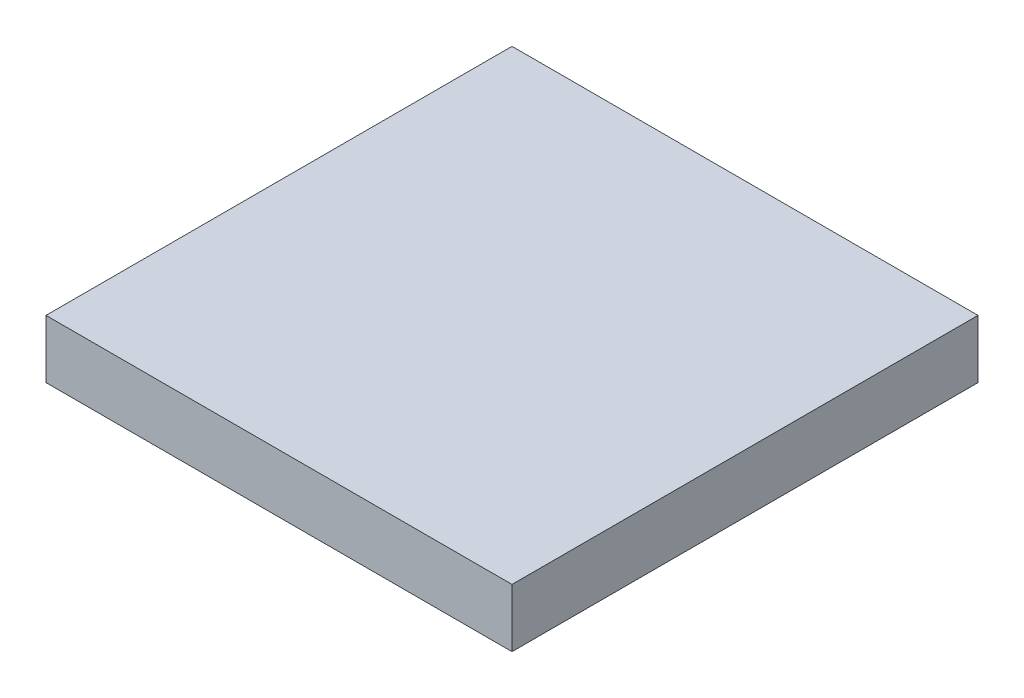
ISO-10303-21;
HEADER;
FILE_DESCRIPTION(('STEP AP214'),'2;1');
FILE_NAME('part.step','',(''),(''),'','','');
FILE_SCHEMA(('AUTOMOTIVE_DESIGN { 1 0 10303 214 1 1 1 1 }'));
ENDSEC;
DATA;
#1=APPLICATION_CONTEXT('core data for automotive mechanical design processes');
#2=APPLICATION_PROTOCOL_DEFINITION('international standard','automotive_design',2000,#1);
#3=PRODUCT_CONTEXT('',#1,'mechanical');
#4=PRODUCT('Part','Part','',(#3));
#5=PRODUCT_RELATED_PRODUCT_CATEGORY('part','',(#4));
#6=PRODUCT_DEFINITION_FORMATION('','',#4);
#7=PRODUCT_DEFINITION_CONTEXT('part definition',#1,'design');
#8=PRODUCT_DEFINITION('design','',#6,#7);
#9=PRODUCT_DEFINITION_SHAPE('','',#8);
#10=(LENGTH_UNIT() NAMED_UNIT(*) SI_UNIT(.MILLI.,.METRE.));
#11=(NAMED_UNIT(*) PLANE_ANGLE_UNIT() SI_UNIT($,.RADIAN.));
#12=(NAMED_UNIT(*) SI_UNIT($,.STERADIAN.) SOLID_ANGLE_UNIT());
#13=UNCERTAINTY_MEASURE_WITH_UNIT(LENGTH_MEASURE(1.E-05),#10,'distance_accuracy_value','');
#14=(GEOMETRIC_REPRESENTATION_CONTEXT(3) GLOBAL_UNCERTAINTY_ASSIGNED_CONTEXT((#13)) GLOBAL_UNIT_ASSIGNED_CONTEXT((#10,
#11,#12)) REPRESENTATION_CONTEXT('',''));
#15=CARTESIAN_POINT('',(0.,0.,0.));
#16=DIRECTION('',(0.,0.,1.));
#17=DIRECTION('',(1.,0.,0.));
#18=AXIS2_PLACEMENT_3D('',#15,#16,#17);
#19=CARTESIAN_POINT('',(-0.2,0.05,-0.2));
#20=DIRECTION('',(1.,0.,0.));
#21=DIRECTION('',(0.,0.,-1.));
#22=AXIS2_PLACEMENT_3D('',#19,#20,#21);
#23=PLANE('',#22);
#24=DIRECTION('',(0.,0.,1.));
#25=VECTOR('',#24,1.);
#26=CARTESIAN_POINT('',(-0.2,0.,-0.2));
#27=LINE('',#26,#25);
#28=CARTESIAN_POINT('',(-0.2,0.,-0.2));
#29=VERTEX_POINT('',#28);
#30=CARTESIAN_POINT('',(-0.2,0.,0.2));
#31=VERTEX_POINT('',#30);
#32=EDGE_CURVE('E92',#29,#31,#27,.T.);
#33=ORIENTED_EDGE('',*,*,#32,.T.);
#34=DIRECTION('',(0.,-1.,0.));
#35=VECTOR('',#34,1.);
#36=CARTESIAN_POINT('',(-0.2,0.05,0.2));
#37=LINE('',#36,#35);
#38=CARTESIAN_POINT('',(-0.2,0.05,0.2));
#39=VERTEX_POINT('',#38);
#40=EDGE_CURVE('E11',#39,#31,#37,.T.);
#41=ORIENTED_EDGE('',*,*,#40,.F.);
#42=DIRECTION('',(0.,0.,1.));
#43=VECTOR('',#42,1.);
#44=CARTESIAN_POINT('',(-0.2,0.05,-0.2));
#45=LINE('',#44,#43);
#46=CARTESIAN_POINT('',(-0.2,0.05,-0.2));
#47=VERTEX_POINT('',#46);
#48=EDGE_CURVE('E80',#47,#39,#45,.T.);
#49=ORIENTED_EDGE('',*,*,#48,.F.);
#50=DIRECTION('',(0.,-1.,0.));
#51=VECTOR('',#50,1.);
#52=CARTESIAN_POINT('',(-0.2,0.05,-0.2));
#53=LINE('',#52,#51);
#54=EDGE_CURVE('E88',#47,#29,#53,.T.);
#55=ORIENTED_EDGE('',*,*,#54,.T.);
#56=EDGE_LOOP('',(#33,#41,#49,#55));
#57=FACE_BOUND('',#56,.T.);
#58=ADVANCED_FACE('F29',(#57),#23,.F.);
#59=CARTESIAN_POINT('',(-0.2,0.05,0.2));
#60=DIRECTION('',(0.,0.,-1.));
#61=DIRECTION('',(-1.,0.,0.));
#62=AXIS2_PLACEMENT_3D('',#59,#60,#61);
#63=PLANE('',#62);
#64=DIRECTION('',(1.,0.,0.));
#65=VECTOR('',#64,1.);
#66=CARTESIAN_POINT('',(-0.2,0.,0.2));
#67=LINE('',#66,#65);
#68=CARTESIAN_POINT('',(0.2,0.,0.2));
#69=VERTEX_POINT('',#68);
#70=EDGE_CURVE('E84',#31,#69,#67,.T.);
#71=ORIENTED_EDGE('',*,*,#70,.T.);
#72=DIRECTION('',(0.,-1.,0.));
#73=VECTOR('',#72,1.);
#74=CARTESIAN_POINT('',(0.2,0.05,0.2));
#75=LINE('',#74,#73);
#76=CARTESIAN_POINT('',(0.2,0.05,0.2));
#77=VERTEX_POINT('',#76);
#78=EDGE_CURVE('E37',#77,#69,#75,.T.);
#79=ORIENTED_EDGE('',*,*,#78,.F.);
#80=DIRECTION('',(1.,0.,0.));
#81=VECTOR('',#80,1.);
#82=CARTESIAN_POINT('',(-0.2,0.05,0.2));
#83=LINE('',#82,#81);
#84=EDGE_CURVE('E75',#39,#77,#83,.T.);
#85=ORIENTED_EDGE('',*,*,#84,.F.);
#86=ORIENTED_EDGE('',*,*,#40,.T.);
#87=EDGE_LOOP('',(#71,#79,#85,#86));
#88=FACE_BOUND('',#87,.T.);
#89=ADVANCED_FACE('F83',(#88),#63,.F.);
#90=CARTESIAN_POINT('',(0.2,0.05,-0.2));
#91=DIRECTION('',(-1.,0.,0.));
#92=DIRECTION('',(0.,0.,1.));
#93=AXIS2_PLACEMENT_3D('',#90,#91,#92);
#94=PLANE('',#93);
#95=DIRECTION('',(0.,0.,-1.));
#96=VECTOR('',#95,1.);
#97=CARTESIAN_POINT('',(0.2,0.,-0.2));
#98=LINE('',#97,#96);
#99=CARTESIAN_POINT('',(0.2,0.,-0.2));
#100=VERTEX_POINT('',#99);
#101=EDGE_CURVE('E62',#69,#100,#98,.T.);
#102=ORIENTED_EDGE('',*,*,#101,.T.);
#103=DIRECTION('',(0.,-1.,0.));
#104=VECTOR('',#103,1.);
#105=CARTESIAN_POINT('',(0.2,0.05,-0.2));
#106=LINE('',#105,#104);
#107=CARTESIAN_POINT('',(0.2,0.05,-0.2));
#108=VERTEX_POINT('',#107);
#109=EDGE_CURVE('E85',#108,#100,#106,.T.);
#110=ORIENTED_EDGE('',*,*,#109,.F.);
#111=DIRECTION('',(0.,0.,-1.));
#112=VECTOR('',#111,1.);
#113=CARTESIAN_POINT('',(0.2,0.05,-0.2));
#114=LINE('',#113,#112);
#115=EDGE_CURVE('E78',#77,#108,#114,.T.);
#116=ORIENTED_EDGE('',*,*,#115,.F.);
#117=ORIENTED_EDGE('',*,*,#78,.T.);
#118=EDGE_LOOP('',(#102,#110,#116,#117));
#119=FACE_BOUND('',#118,.T.);
#120=ADVANCED_FACE('F86',(#119),#94,.F.);
#121=CARTESIAN_POINT('',(-0.2,0.05,-0.2));
#122=DIRECTION('',(0.,0.,1.));
#123=DIRECTION('',(1.,0.,0.));
#124=AXIS2_PLACEMENT_3D('',#121,#122,#123);
#125=PLANE('',#124);
#126=DIRECTION('',(-1.,0.,0.));
#127=VECTOR('',#126,1.);
#128=CARTESIAN_POINT('',(-0.2,0.,-0.2));
#129=LINE('',#128,#127);
#130=EDGE_CURVE('E68',#100,#29,#129,.T.);
#131=ORIENTED_EDGE('',*,*,#130,.T.);
#132=ORIENTED_EDGE('',*,*,#54,.F.);
#133=DIRECTION('',(-1.,0.,0.));
#134=VECTOR('',#133,1.);
#135=CARTESIAN_POINT('',(-0.2,0.05,-0.2));
#136=LINE('',#135,#134);
#137=EDGE_CURVE('E45',#108,#47,#136,.T.);
#138=ORIENTED_EDGE('',*,*,#137,.F.);
#139=ORIENTED_EDGE('',*,*,#109,.T.);
#140=EDGE_LOOP('',(#131,#132,#138,#139));
#141=FACE_BOUND('',#140,.T.);
#142=ADVANCED_FACE('F99',(#141),#125,.F.);
#143=CARTESIAN_POINT('',(0.,0.05,0.));
#144=DIRECTION('',(0.,1.,0.));
#145=DIRECTION('',(0.,0.,1.));
#146=AXIS2_PLACEMENT_3D('',#143,#144,#145);
#147=PLANE('',#146);
#148=ORIENTED_EDGE('',*,*,#48,.T.);
#149=ORIENTED_EDGE('',*,*,#84,.T.);
#150=ORIENTED_EDGE('',*,*,#115,.T.);
#151=ORIENTED_EDGE('',*,*,#137,.T.);
#152=EDGE_LOOP('',(#148,#149,#150,#151));
#153=FACE_BOUND('',#152,.T.);
#154=ADVANCED_FACE('F76',(#153),#147,.T.);
#155=CARTESIAN_POINT('',(0.,0.,0.));
#156=DIRECTION('',(0.,1.,0.));
#157=DIRECTION('',(0.,0.,1.));
#158=AXIS2_PLACEMENT_3D('',#155,#156,#157);
#159=PLANE('',#158);
#160=ORIENTED_EDGE('',*,*,#32,.F.);
#161=ORIENTED_EDGE('',*,*,#130,.F.);
#162=ORIENTED_EDGE('',*,*,#101,.F.);
#163=ORIENTED_EDGE('',*,*,#70,.F.);
#164=EDGE_LOOP('',(#160,#161,#162,#163));
#165=FACE_BOUND('',#164,.T.);
#166=ADVANCED_FACE('F102',(#165),#159,.F.);
#167=CLOSED_SHELL('',(#58,#89,#120,#142,#154,#166));
#168=MANIFOLD_SOLID_BREP('B2',#167);
#169=ADVANCED_BREP_SHAPE_REPRESENTATION('',(#18,#168),#14);
#170=SHAPE_DEFINITION_REPRESENTATION(#9,#169);
ENDSEC;
END-ISO-10303-21;
